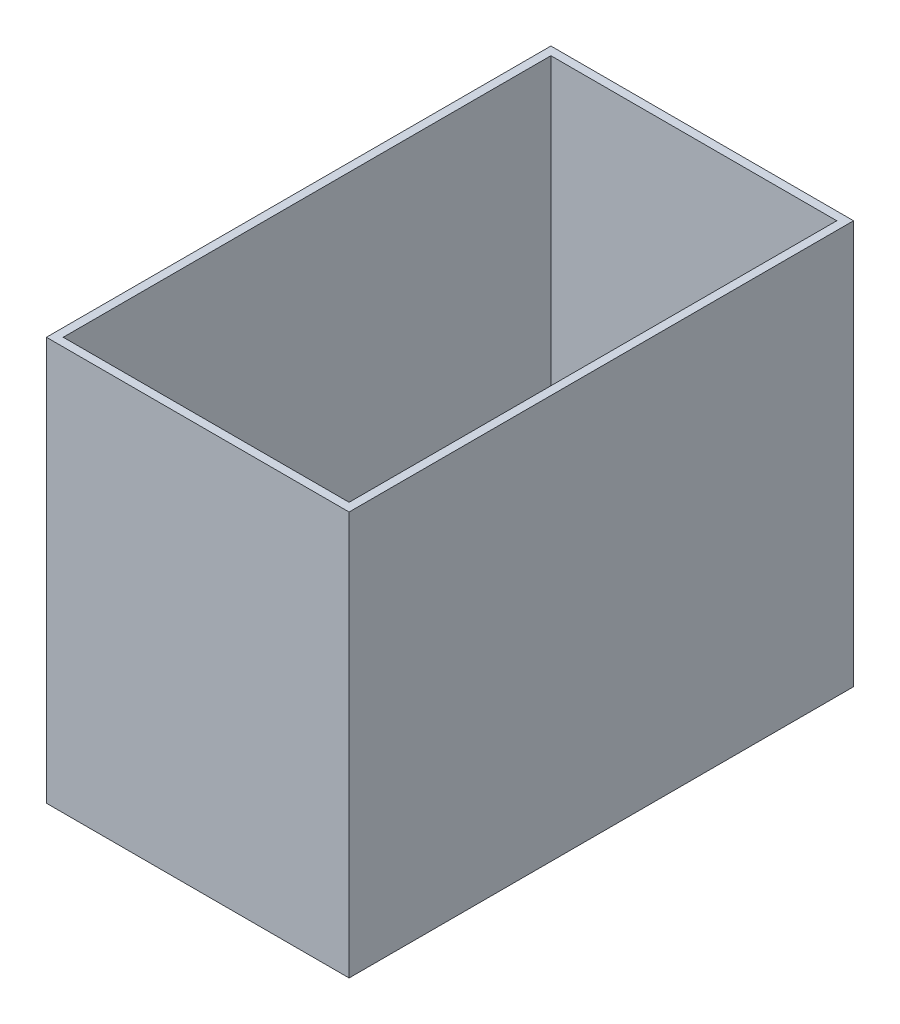
ISO-10303-21;
HEADER;
FILE_DESCRIPTION(('STEP AP214'),'2;1');
FILE_NAME('part.step','',(''),(''),'','','');
FILE_SCHEMA(('AUTOMOTIVE_DESIGN { 1 0 10303 214 1 1 1 1 }'));
ENDSEC;
DATA;
#1=APPLICATION_CONTEXT('core data for automotive mechanical design processes');
#2=APPLICATION_PROTOCOL_DEFINITION('international standard','automotive_design',2000,#1);
#3=PRODUCT_CONTEXT('',#1,'mechanical');
#4=PRODUCT('Part','Part','',(#3));
#5=PRODUCT_RELATED_PRODUCT_CATEGORY('part','',(#4));
#6=PRODUCT_DEFINITION_FORMATION('','',#4);
#7=PRODUCT_DEFINITION_CONTEXT('part definition',#1,'design');
#8=PRODUCT_DEFINITION('design','',#6,#7);
#9=PRODUCT_DEFINITION_SHAPE('','',#8);
#10=(LENGTH_UNIT() NAMED_UNIT(*) SI_UNIT(.MILLI.,.METRE.));
#11=(NAMED_UNIT(*) PLANE_ANGLE_UNIT() SI_UNIT($,.RADIAN.));
#12=(NAMED_UNIT(*) SI_UNIT($,.STERADIAN.) SOLID_ANGLE_UNIT());
#13=UNCERTAINTY_MEASURE_WITH_UNIT(LENGTH_MEASURE(1.E-05),#10,'distance_accuracy_value','');
#14=(GEOMETRIC_REPRESENTATION_CONTEXT(3) GLOBAL_UNCERTAINTY_ASSIGNED_CONTEXT((#13)) GLOBAL_UNIT_ASSIGNED_CONTEXT((#10,
#11,#12)) REPRESENTATION_CONTEXT('',''));
#15=CARTESIAN_POINT('',(0.,0.,0.));
#16=DIRECTION('',(0.,0.,1.));
#17=DIRECTION('',(1.,0.,0.));
#18=AXIS2_PLACEMENT_3D('',#15,#16,#17);
#19=CARTESIAN_POINT('',(0.,304.8,0.));
#20=DIRECTION('',(1.,0.,0.));
#21=DIRECTION('',(0.,0.,-1.));
#22=AXIS2_PLACEMENT_3D('',#19,#20,#21);
#23=PLANE('',#22);
#24=DIRECTION('',(0.,0.,1.));
#25=VECTOR('',#24,1.);
#26=CARTESIAN_POINT('',(0.,0.,0.));
#27=LINE('',#26,#25);
#28=CARTESIAN_POINT('',(0.,0.,-381.));
#29=VERTEX_POINT('',#28);
#30=CARTESIAN_POINT('',(0.,0.,0.));
#31=VERTEX_POINT('',#30);
#32=EDGE_CURVE('E141',#29,#31,#27,.T.);
#33=ORIENTED_EDGE('',*,*,#32,.T.);
#34=DIRECTION('',(0.,-1.,0.));
#35=VECTOR('',#34,1.);
#36=CARTESIAN_POINT('',(0.,304.8,0.));
#37=LINE('',#36,#35);
#38=CARTESIAN_POINT('',(0.,304.8,0.));
#39=VERTEX_POINT('',#38);
#40=EDGE_CURVE('E11',#39,#31,#37,.T.);
#41=ORIENTED_EDGE('',*,*,#40,.F.);
#42=DIRECTION('',(0.,0.,1.));
#43=VECTOR('',#42,1.);
#44=CARTESIAN_POINT('',(0.,304.8,0.));
#45=LINE('',#44,#43);
#46=CARTESIAN_POINT('',(0.,304.8,-381.));
#47=VERTEX_POINT('',#46);
#48=EDGE_CURVE('E145',#47,#39,#45,.T.);
#49=ORIENTED_EDGE('',*,*,#48,.F.);
#50=DIRECTION('',(0.,-1.,0.));
#51=VECTOR('',#50,1.);
#52=CARTESIAN_POINT('',(0.,304.8,-381.));
#53=LINE('',#52,#51);
#54=EDGE_CURVE('E151',#47,#29,#53,.T.);
#55=ORIENTED_EDGE('',*,*,#54,.T.);
#56=EDGE_LOOP('',(#33,#41,#49,#55));
#57=FACE_BOUND('',#56,.T.);
#58=ADVANCED_FACE('F33',(#57),#23,.F.);
#59=CARTESIAN_POINT('',(0.,304.8,0.));
#60=DIRECTION('',(0.,0.,-1.));
#61=DIRECTION('',(-1.,0.,0.));
#62=AXIS2_PLACEMENT_3D('',#59,#60,#61);
#63=PLANE('',#62);
#64=DIRECTION('',(1.,0.,0.));
#65=VECTOR('',#64,1.);
#66=CARTESIAN_POINT('',(0.,0.,0.));
#67=LINE('',#66,#65);
#68=CARTESIAN_POINT('',(228.6,0.,0.));
#69=VERTEX_POINT('',#68);
#70=EDGE_CURVE('E154',#31,#69,#67,.T.);
#71=ORIENTED_EDGE('',*,*,#70,.T.);
#72=DIRECTION('',(0.,-1.,0.));
#73=VECTOR('',#72,1.);
#74=CARTESIAN_POINT('',(228.6,304.8,0.));
#75=LINE('',#74,#73);
#76=CARTESIAN_POINT('',(228.6,304.8,0.));
#77=VERTEX_POINT('',#76);
#78=EDGE_CURVE('E40',#77,#69,#75,.T.);
#79=ORIENTED_EDGE('',*,*,#78,.F.);
#80=DIRECTION('',(1.,0.,0.));
#81=VECTOR('',#80,1.);
#82=CARTESIAN_POINT('',(0.,304.8,0.));
#83=LINE('',#82,#81);
#84=EDGE_CURVE('E84',#39,#77,#83,.T.);
#85=ORIENTED_EDGE('',*,*,#84,.F.);
#86=ORIENTED_EDGE('',*,*,#40,.T.);
#87=EDGE_LOOP('',(#71,#79,#85,#86));
#88=FACE_BOUND('',#87,.T.);
#89=ADVANCED_FACE('F183',(#88),#63,.F.);
#90=CARTESIAN_POINT('',(228.6,304.8,0.));
#91=DIRECTION('',(-1.,0.,0.));
#92=DIRECTION('',(0.,0.,1.));
#93=AXIS2_PLACEMENT_3D('',#90,#91,#92);
#94=PLANE('',#93);
#95=DIRECTION('',(0.,0.,-1.));
#96=VECTOR('',#95,1.);
#97=CARTESIAN_POINT('',(228.6,0.,0.));
#98=LINE('',#97,#96);
#99=CARTESIAN_POINT('',(228.6,0.,-381.));
#100=VERTEX_POINT('',#99);
#101=EDGE_CURVE('E156',#69,#100,#98,.T.);
#102=ORIENTED_EDGE('',*,*,#101,.T.);
#103=DIRECTION('',(0.,-1.,0.));
#104=VECTOR('',#103,1.);
#105=CARTESIAN_POINT('',(228.6,304.8,-381.));
#106=LINE('',#105,#104);
#107=CARTESIAN_POINT('',(228.6,304.8,-381.));
#108=VERTEX_POINT('',#107);
#109=EDGE_CURVE('E160',#108,#100,#106,.T.);
#110=ORIENTED_EDGE('',*,*,#109,.F.);
#111=DIRECTION('',(0.,0.,-1.));
#112=VECTOR('',#111,1.);
#113=CARTESIAN_POINT('',(228.6,304.8,0.));
#114=LINE('',#113,#112);
#115=EDGE_CURVE('E148',#77,#108,#114,.T.);
#116=ORIENTED_EDGE('',*,*,#115,.F.);
#117=ORIENTED_EDGE('',*,*,#78,.T.);
#118=EDGE_LOOP('',(#102,#110,#116,#117));
#119=FACE_BOUND('',#118,.T.);
#120=ADVANCED_FACE('F165',(#119),#94,.F.);
#121=CARTESIAN_POINT('',(0.,304.8,-381.));
#122=DIRECTION('',(0.,0.,1.));
#123=DIRECTION('',(1.,0.,0.));
#124=AXIS2_PLACEMENT_3D('',#121,#122,#123);
#125=PLANE('',#124);
#126=DIRECTION('',(-1.,0.,0.));
#127=VECTOR('',#126,1.);
#128=CARTESIAN_POINT('',(0.,0.,-381.));
#129=LINE('',#128,#127);
#130=EDGE_CURVE('E77',#100,#29,#129,.T.);
#131=ORIENTED_EDGE('',*,*,#130,.T.);
#132=ORIENTED_EDGE('',*,*,#54,.F.);
#133=DIRECTION('',(-1.,0.,0.));
#134=VECTOR('',#133,1.);
#135=CARTESIAN_POINT('',(0.,304.8,-381.));
#136=LINE('',#135,#134);
#137=EDGE_CURVE('E56',#108,#47,#136,.T.);
#138=ORIENTED_EDGE('',*,*,#137,.F.);
#139=ORIENTED_EDGE('',*,*,#109,.T.);
#140=EDGE_LOOP('',(#131,#132,#138,#139));
#141=FACE_BOUND('',#140,.T.);
#142=ADVANCED_FACE('F173',(#141),#125,.F.);
#143=CARTESIAN_POINT('',(0.,304.8,0.));
#144=DIRECTION('',(0.,-1.,0.));
#145=DIRECTION('',(0.,0.,-1.));
#146=AXIS2_PLACEMENT_3D('',#143,#144,#145);
#147=PLANE('',#146);
#148=DIRECTION('',(1.,0.,0.));
#149=VECTOR('',#148,1.);
#150=CARTESIAN_POINT('',(6.35000000000005,304.8,-6.35));
#151=LINE('',#150,#149);
#152=CARTESIAN_POINT('',(6.35000000000005,304.8,-6.35));
#153=VERTEX_POINT('',#152);
#154=CARTESIAN_POINT('',(222.25,304.8,-6.35));
#155=VERTEX_POINT('',#154);
#156=EDGE_CURVE('E135',#153,#155,#151,.T.);
#157=ORIENTED_EDGE('',*,*,#156,.F.);
#158=DIRECTION('',(0.,0.,1.));
#159=VECTOR('',#158,1.);
#160=CARTESIAN_POINT('',(6.35,304.8,-374.65));
#161=LINE('',#160,#159);
#162=CARTESIAN_POINT('',(6.35,304.8,-374.65));
#163=VERTEX_POINT('',#162);
#164=EDGE_CURVE('E47',#163,#153,#161,.T.);
#165=ORIENTED_EDGE('',*,*,#164,.F.);
#166=DIRECTION('',(-1.,0.,0.));
#167=VECTOR('',#166,1.);
#168=CARTESIAN_POINT('',(6.35,304.8,-374.65));
#169=LINE('',#168,#167);
#170=CARTESIAN_POINT('',(222.25,304.8,-374.65));
#171=VERTEX_POINT('',#170);
#172=EDGE_CURVE('E126',#171,#163,#169,.T.);
#173=ORIENTED_EDGE('',*,*,#172,.F.);
#174=DIRECTION('',(0.,0.,-1.));
#175=VECTOR('',#174,1.);
#176=CARTESIAN_POINT('',(222.25,304.8,-374.65));
#177=LINE('',#176,#175);
#178=EDGE_CURVE('E129',#155,#171,#177,.T.);
#179=ORIENTED_EDGE('',*,*,#178,.F.);
#180=EDGE_LOOP('',(#157,#165,#173,#179));
#181=FACE_BOUND('',#180,.T.);
#182=ORIENTED_EDGE('',*,*,#48,.T.);
#183=ORIENTED_EDGE('',*,*,#84,.T.);
#184=ORIENTED_EDGE('',*,*,#115,.T.);
#185=ORIENTED_EDGE('',*,*,#137,.T.);
#186=EDGE_LOOP('',(#182,#183,#184,#185));
#187=FACE_BOUND('',#186,.T.);
#188=ADVANCED_FACE('F175',(#181,#187),#147,.F.);
#189=CARTESIAN_POINT('',(0.,0.,0.));
#190=DIRECTION('',(0.,-1.,0.));
#191=DIRECTION('',(0.,0.,-1.));
#192=AXIS2_PLACEMENT_3D('',#189,#190,#191);
#193=PLANE('',#192);
#194=ORIENTED_EDGE('',*,*,#32,.F.);
#195=ORIENTED_EDGE('',*,*,#130,.F.);
#196=ORIENTED_EDGE('',*,*,#101,.F.);
#197=ORIENTED_EDGE('',*,*,#70,.F.);
#198=EDGE_LOOP('',(#194,#195,#196,#197));
#199=FACE_BOUND('',#198,.T.);
#200=ADVANCED_FACE('F169',(#199),#193,.T.);
#201=CARTESIAN_POINT('',(6.35,6.35000000000002,-374.65));
#202=DIRECTION('',(-1.,0.,0.));
#203=DIRECTION('',(0.,0.,1.));
#204=AXIS2_PLACEMENT_3D('',#201,#202,#203);
#205=PLANE('',#204);
#206=ORIENTED_EDGE('',*,*,#164,.T.);
#207=DIRECTION('',(0.,1.,0.));
#208=VECTOR('',#207,1.);
#209=CARTESIAN_POINT('',(6.35000000000005,6.35000000000002,-6.35));
#210=LINE('',#209,#208);
#211=CARTESIAN_POINT('',(6.35000000000005,6.35000000000002,-6.35));
#212=VERTEX_POINT('',#211);
#213=EDGE_CURVE('E104',#212,#153,#210,.T.);
#214=ORIENTED_EDGE('',*,*,#213,.F.);
#215=DIRECTION('',(0.,0.,1.));
#216=VECTOR('',#215,1.);
#217=CARTESIAN_POINT('',(6.35,6.35000000000002,-374.65));
#218=LINE('',#217,#216);
#219=CARTESIAN_POINT('',(6.35,6.35000000000002,-374.65));
#220=VERTEX_POINT('',#219);
#221=EDGE_CURVE('E108',#220,#212,#218,.T.);
#222=ORIENTED_EDGE('',*,*,#221,.F.);
#223=DIRECTION('',(0.,1.,0.));
#224=VECTOR('',#223,1.);
#225=CARTESIAN_POINT('',(6.35,6.35000000000002,-374.65));
#226=LINE('',#225,#224);
#227=EDGE_CURVE('E139',#220,#163,#226,.T.);
#228=ORIENTED_EDGE('',*,*,#227,.T.);
#229=EDGE_LOOP('',(#206,#214,#222,#228));
#230=FACE_BOUND('',#229,.T.);
#231=ADVANCED_FACE('F106',(#230),#205,.F.);
#232=CARTESIAN_POINT('',(6.35,6.35000000000002,-374.65));
#233=DIRECTION('',(0.,0.,-1.));
#234=DIRECTION('',(-1.,0.,0.));
#235=AXIS2_PLACEMENT_3D('',#232,#233,#234);
#236=PLANE('',#235);
#237=ORIENTED_EDGE('',*,*,#172,.T.);
#238=ORIENTED_EDGE('',*,*,#227,.F.);
#239=DIRECTION('',(-1.,0.,0.));
#240=VECTOR('',#239,1.);
#241=CARTESIAN_POINT('',(6.35,6.35000000000002,-374.65));
#242=LINE('',#241,#240);
#243=CARTESIAN_POINT('',(222.25,6.35000000000002,-374.65));
#244=VERTEX_POINT('',#243);
#245=EDGE_CURVE('E114',#244,#220,#242,.T.);
#246=ORIENTED_EDGE('',*,*,#245,.F.);
#247=DIRECTION('',(0.,1.,0.));
#248=VECTOR('',#247,1.);
#249=CARTESIAN_POINT('',(222.25,6.35000000000002,-374.65));
#250=LINE('',#249,#248);
#251=EDGE_CURVE('E142',#244,#171,#250,.T.);
#252=ORIENTED_EDGE('',*,*,#251,.T.);
#253=EDGE_LOOP('',(#237,#238,#246,#252));
#254=FACE_BOUND('',#253,.T.);
#255=ADVANCED_FACE('F222',(#254),#236,.F.);
#256=CARTESIAN_POINT('',(222.25,6.35000000000002,-374.65));
#257=DIRECTION('',(1.,0.,0.));
#258=DIRECTION('',(0.,0.,-1.));
#259=AXIS2_PLACEMENT_3D('',#256,#257,#258);
#260=PLANE('',#259);
#261=ORIENTED_EDGE('',*,*,#178,.T.);
#262=ORIENTED_EDGE('',*,*,#251,.F.);
#263=DIRECTION('',(0.,0.,-1.));
#264=VECTOR('',#263,1.);
#265=CARTESIAN_POINT('',(222.25,6.35000000000002,-374.65));
#266=LINE('',#265,#264);
#267=CARTESIAN_POINT('',(222.25,6.35000000000002,-6.35));
#268=VERTEX_POINT('',#267);
#269=EDGE_CURVE('E122',#268,#244,#266,.T.);
#270=ORIENTED_EDGE('',*,*,#269,.F.);
#271=DIRECTION('',(0.,1.,0.));
#272=VECTOR('',#271,1.);
#273=CARTESIAN_POINT('',(222.25,6.35000000000002,-6.35));
#274=LINE('',#273,#272);
#275=EDGE_CURVE('E113',#268,#155,#274,.T.);
#276=ORIENTED_EDGE('',*,*,#275,.T.);
#277=EDGE_LOOP('',(#261,#262,#270,#276));
#278=FACE_BOUND('',#277,.T.);
#279=ADVANCED_FACE('F231',(#278),#260,.F.);
#280=CARTESIAN_POINT('',(6.35000000000005,6.35000000000002,-6.35));
#281=DIRECTION('',(0.,0.,1.));
#282=DIRECTION('',(1.,0.,0.));
#283=AXIS2_PLACEMENT_3D('',#280,#281,#282);
#284=PLANE('',#283);
#285=ORIENTED_EDGE('',*,*,#156,.T.);
#286=ORIENTED_EDGE('',*,*,#275,.F.);
#287=DIRECTION('',(1.,0.,0.));
#288=VECTOR('',#287,1.);
#289=CARTESIAN_POINT('',(6.35000000000005,6.35000000000002,-6.35));
#290=LINE('',#289,#288);
#291=EDGE_CURVE('E117',#212,#268,#290,.T.);
#292=ORIENTED_EDGE('',*,*,#291,.F.);
#293=ORIENTED_EDGE('',*,*,#213,.T.);
#294=EDGE_LOOP('',(#285,#286,#292,#293));
#295=FACE_BOUND('',#294,.T.);
#296=ADVANCED_FACE('F118',(#295),#284,.F.);
#297=CARTESIAN_POINT('',(0.,6.35000000000002,0.));
#298=DIRECTION('',(0.,1.,0.));
#299=DIRECTION('',(0.,0.,1.));
#300=AXIS2_PLACEMENT_3D('',#297,#298,#299);
#301=PLANE('',#300);
#302=ORIENTED_EDGE('',*,*,#221,.T.);
#303=ORIENTED_EDGE('',*,*,#291,.T.);
#304=ORIENTED_EDGE('',*,*,#269,.T.);
#305=ORIENTED_EDGE('',*,*,#245,.T.);
#306=EDGE_LOOP('',(#302,#303,#304,#305));
#307=FACE_BOUND('',#306,.T.);
#308=ADVANCED_FACE('F124',(#307),#301,.T.);
#309=CLOSED_SHELL('',(#58,#89,#120,#142,#188,#200,#231,#255,#279,#296,#308));
#310=MANIFOLD_SOLID_BREP('B2',#309);
#311=ADVANCED_BREP_SHAPE_REPRESENTATION('',(#18,#310),#14);
#312=SHAPE_DEFINITION_REPRESENTATION(#9,#311);
ENDSEC;
END-ISO-10303-21;
